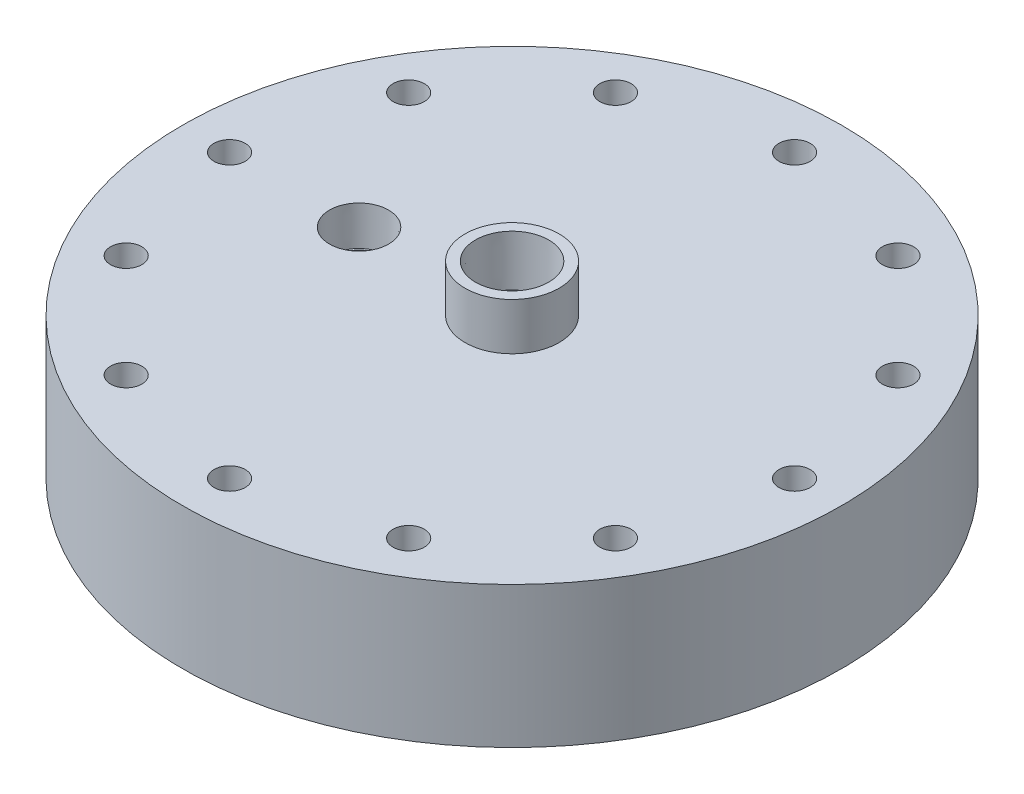
ISO-10303-21;
HEADER;
FILE_DESCRIPTION(('STEP AP214'),'2;1');
FILE_NAME('part.step','',(''),(''),'','','');
FILE_SCHEMA(('AUTOMOTIVE_DESIGN { 1 0 10303 214 1 1 1 1 }'));
ENDSEC;
DATA;
#1=APPLICATION_CONTEXT('core data for automotive mechanical design processes');
#2=APPLICATION_PROTOCOL_DEFINITION('international standard','automotive_design',2000,#1);
#3=PRODUCT_CONTEXT('',#1,'mechanical');
#4=PRODUCT('Part','Part','',(#3));
#5=PRODUCT_RELATED_PRODUCT_CATEGORY('part','',(#4));
#6=PRODUCT_DEFINITION_FORMATION('','',#4);
#7=PRODUCT_DEFINITION_CONTEXT('part definition',#1,'design');
#8=PRODUCT_DEFINITION('design','',#6,#7);
#9=PRODUCT_DEFINITION_SHAPE('','',#8);
#10=(LENGTH_UNIT() NAMED_UNIT(*) SI_UNIT(.MILLI.,.METRE.));
#11=(NAMED_UNIT(*) PLANE_ANGLE_UNIT() SI_UNIT($,.RADIAN.));
#12=(NAMED_UNIT(*) SI_UNIT($,.STERADIAN.) SOLID_ANGLE_UNIT());
#13=UNCERTAINTY_MEASURE_WITH_UNIT(LENGTH_MEASURE(1.E-05),#10,'distance_accuracy_value','');
#14=(GEOMETRIC_REPRESENTATION_CONTEXT(3) GLOBAL_UNCERTAINTY_ASSIGNED_CONTEXT((#13)) GLOBAL_UNIT_ASSIGNED_CONTEXT((#10,
#11,#12)) REPRESENTATION_CONTEXT('',''));
#15=CARTESIAN_POINT('',(0.,0.,0.));
#16=DIRECTION('',(0.,0.,1.));
#17=DIRECTION('',(1.,0.,0.));
#18=AXIS2_PLACEMENT_3D('',#15,#16,#17);
#19=CARTESIAN_POINT('',(-31.75,12.7,0.));
#20=DIRECTION('',(0.,1.,0.));
#21=DIRECTION('',(0.,0.,1.));
#22=AXIS2_PLACEMENT_3D('',#19,#20,#21);
#23=PLANE('',#22);
#24=CARTESIAN_POINT('',(0.,12.7,0.));
#25=DIRECTION('',(0.,-1.,0.));
#26=DIRECTION('',(0.,0.,-1.));
#27=AXIS2_PLACEMENT_3D('',#24,#25,#26);
#28=CIRCLE('',#27,31.75);
#29=CARTESIAN_POINT('',(0.,12.7,-31.75));
#30=VERTEX_POINT('',#29);
#31=EDGE_CURVE('E73',#30,#30,#28,.T.);
#32=ORIENTED_EDGE('',*,*,#31,.F.);
#33=EDGE_LOOP('',(#32));
#34=FACE_BOUND('',#33,.T.);
#35=CARTESIAN_POINT('',(0.,12.7,0.));
#36=DIRECTION('',(0.,-1.,0.));
#37=DIRECTION('',(0.,0.,-1.));
#38=AXIS2_PLACEMENT_3D('',#35,#36,#37);
#39=CIRCLE('',#38,50.8);
#40=CARTESIAN_POINT('',(0.,12.7,-50.8));
#41=VERTEX_POINT('',#40);
#42=EDGE_CURVE('E77',#41,#41,#39,.T.);
#43=ORIENTED_EDGE('',*,*,#42,.T.);
#44=EDGE_LOOP('',(#43));
#45=FACE_BOUND('',#44,.T.);
#46=CARTESIAN_POINT('',(-41.275,12.7,0.));
#47=DIRECTION('',(0.,1.,0.));
#48=DIRECTION('',(0.,0.,1.));
#49=AXIS2_PLACEMENT_3D('',#46,#47,#48);
#50=CIRCLE('',#49,7.1374);
#51=CARTESIAN_POINT('',(-41.275,12.7,7.1374));
#52=VERTEX_POINT('',#51);
#53=EDGE_CURVE('E117',#52,#52,#50,.F.);
#54=ORIENTED_EDGE('',*,*,#53,.F.);
#55=EDGE_LOOP('',(#54));
#56=FACE_BOUND('',#55,.T.);
#57=ADVANCED_FACE('F41',(#34,#45,#56),#23,.F.);
#58=CARTESIAN_POINT('',(0.,0.,0.));
#59=DIRECTION('',(0.,-1.,0.));
#60=DIRECTION('',(0.,0.,-1.));
#61=AXIS2_PLACEMENT_3D('',#58,#59,#60);
#62=CYLINDRICAL_SURFACE('',#61,88.9);
#63=CARTESIAN_POINT('',(0.,0.,0.));
#64=DIRECTION('',(0.,-1.,0.));
#65=DIRECTION('',(0.,0.,-1.));
#66=AXIS2_PLACEMENT_3D('',#63,#64,#65);
#67=CIRCLE('',#66,88.9);
#68=CARTESIAN_POINT('',(0.,0.,-88.9));
#69=VERTEX_POINT('',#68);
#70=EDGE_CURVE('E101',#69,#69,#67,.T.);
#71=ORIENTED_EDGE('',*,*,#70,.F.);
#72=EDGE_LOOP('',(#71));
#73=FACE_BOUND('',#72,.T.);
#74=CARTESIAN_POINT('',(0.,38.1,0.));
#75=DIRECTION('',(0.,-1.,0.));
#76=DIRECTION('',(0.,0.,-1.));
#77=AXIS2_PLACEMENT_3D('',#74,#75,#76);
#78=CIRCLE('',#77,88.9);
#79=CARTESIAN_POINT('',(0.,38.1,-88.9));
#80=VERTEX_POINT('',#79);
#81=EDGE_CURVE('E10',#80,#80,#78,.T.);
#82=ORIENTED_EDGE('',*,*,#81,.T.);
#83=EDGE_LOOP('',(#82));
#84=FACE_BOUND('',#83,.T.);
#85=ADVANCED_FACE('F43',(#73,#84),#62,.T.);
#86=CARTESIAN_POINT('',(-88.9,38.1,0.));
#87=DIRECTION('',(0.,-1.,0.));
#88=DIRECTION('',(0.,0.,-1.));
#89=AXIS2_PLACEMENT_3D('',#86,#87,#88);
#90=PLANE('',#89);
#91=CARTESIAN_POINT('',(-38.0999999999999,38.1,65.9911357683743));
#92=DIRECTION('',(0.,1.,0.));
#93=DIRECTION('',(0.86602540378444,0.,0.499999999999998));
#94=AXIS2_PLACEMENT_3D('',#91,#92,#93);
#95=CIRCLE('',#94,4.21639999999999);
#96=CARTESIAN_POINT('',(-34.4484904874831,38.1,68.0993357683743));
#97=VERTEX_POINT('',#96);
#98=EDGE_CURVE('E149',#97,#97,#95,.T.);
#99=ORIENTED_EDGE('',*,*,#98,.F.);
#100=EDGE_LOOP('',(#99));
#101=FACE_BOUND('',#100,.T.);
#102=CARTESIAN_POINT('',(2.66050878019847E-13,38.1,76.2));
#103=DIRECTION('',(0.,1.,0.));
#104=DIRECTION('',(1.,0.,0.));
#105=AXIS2_PLACEMENT_3D('',#102,#103,#104);
#106=CIRCLE('',#105,4.21639999999999);
#107=CARTESIAN_POINT('',(4.21640000000026,38.1,76.2));
#108=VERTEX_POINT('',#107);
#109=EDGE_CURVE('E200',#108,#108,#106,.T.);
#110=ORIENTED_EDGE('',*,*,#109,.F.);
#111=EDGE_LOOP('',(#110));
#112=FACE_BOUND('',#111,.T.);
#113=CARTESIAN_POINT('',(38.1000000000003,38.1,65.9911357683741));
#114=DIRECTION('',(0.,1.,0.));
#115=DIRECTION('',(0.866025403784436,0.,-0.500000000000004));
#116=AXIS2_PLACEMENT_3D('',#113,#114,#115);
#117=CIRCLE('',#116,4.21639999999999);
#118=CARTESIAN_POINT('',(41.751509512517,38.1,63.882935768374));
#119=VERTEX_POINT('',#118);
#120=EDGE_CURVE('E192',#119,#119,#117,.T.);
#121=ORIENTED_EDGE('',*,*,#120,.F.);
#122=EDGE_LOOP('',(#121));
#123=FACE_BOUND('',#122,.T.);
#124=CARTESIAN_POINT('',(65.9911357683744,38.1,38.0999999999996));
#125=DIRECTION('',(0.,1.,0.));
#126=DIRECTION('',(0.499999999999995,0.,-0.866025403784442));
#127=AXIS2_PLACEMENT_3D('',#124,#125,#126);
#128=CIRCLE('',#127,4.21639999999999);
#129=CARTESIAN_POINT('',(68.0993357683744,38.1,34.4484904874829));
#130=VERTEX_POINT('',#129);
#131=EDGE_CURVE('E184',#130,#130,#128,.T.);
#132=ORIENTED_EDGE('',*,*,#131,.F.);
#133=EDGE_LOOP('',(#132));
#134=FACE_BOUND('',#133,.T.);
#135=CARTESIAN_POINT('',(76.2,38.1,0.));
#136=DIRECTION('',(0.,1.,0.));
#137=DIRECTION('',(0.,0.,-1.));
#138=AXIS2_PLACEMENT_3D('',#135,#136,#137);
#139=CIRCLE('',#138,4.21639999999999);
#140=CARTESIAN_POINT('',(76.2,38.1,-4.21639999999999));
#141=VERTEX_POINT('',#140);
#142=EDGE_CURVE('E176',#141,#141,#139,.T.);
#143=ORIENTED_EDGE('',*,*,#142,.F.);
#144=EDGE_LOOP('',(#143));
#145=FACE_BOUND('',#144,.T.);
#146=CARTESIAN_POINT('',(65.9911357683739,38.1,-38.1000000000005));
#147=DIRECTION('',(0.,1.,0.));
#148=DIRECTION('',(-0.500000000000007,0.,-0.866025403784435));
#149=AXIS2_PLACEMENT_3D('',#146,#147,#148);
#150=CIRCLE('',#149,4.21639999999999);
#151=CARTESIAN_POINT('',(63.8829357683739,38.1,-41.7515095125172));
#152=VERTEX_POINT('',#151);
#153=EDGE_CURVE('E168',#152,#152,#150,.T.);
#154=ORIENTED_EDGE('',*,*,#153,.F.);
#155=EDGE_LOOP('',(#154));
#156=FACE_BOUND('',#155,.T.);
#157=CARTESIAN_POINT('',(38.0999999999994,38.1,-65.9911357683746));
#158=DIRECTION('',(0.,1.,0.));
#159=DIRECTION('',(-0.866025403784443,0.,-0.499999999999992));
#160=AXIS2_PLACEMENT_3D('',#157,#158,#159);
#161=CIRCLE('',#160,4.21639999999999);
#162=CARTESIAN_POINT('',(34.4484904874827,38.1,-68.0993357683745));
#163=VERTEX_POINT('',#162);
#164=EDGE_CURVE('E160',#163,#163,#161,.T.);
#165=ORIENTED_EDGE('',*,*,#164,.F.);
#166=EDGE_LOOP('',(#165));
#167=FACE_BOUND('',#166,.T.);
#168=CARTESIAN_POINT('',(-7.9815263405954E-13,38.1,-76.2));
#169=DIRECTION('',(0.,1.,0.));
#170=DIRECTION('',(-1.,0.,0.));
#171=AXIS2_PLACEMENT_3D('',#168,#169,#170);
#172=CIRCLE('',#171,4.21639999999999);
#173=CARTESIAN_POINT('',(-4.21640000000079,38.1,-76.2));
#174=VERTEX_POINT('',#173);
#175=EDGE_CURVE('E150',#174,#174,#172,.T.);
#176=ORIENTED_EDGE('',*,*,#175,.F.);
#177=EDGE_LOOP('',(#176));
#178=FACE_BOUND('',#177,.T.);
#179=CARTESIAN_POINT('',(-38.1000000000008,38.1,-65.9911357683738));
#180=DIRECTION('',(0.,1.,0.));
#181=DIRECTION('',(-0.866025403784433,0.,0.50000000000001));
#182=AXIS2_PLACEMENT_3D('',#179,#180,#181);
#183=CIRCLE('',#182,4.21639999999999);
#184=CARTESIAN_POINT('',(-41.7515095125175,38.1,-63.8829357683737));
#185=VERTEX_POINT('',#184);
#186=EDGE_CURVE('E159',#185,#185,#183,.T.);
#187=ORIENTED_EDGE('',*,*,#186,.F.);
#188=EDGE_LOOP('',(#187));
#189=FACE_BOUND('',#188,.T.);
#190=CARTESIAN_POINT('',(-65.9911357683747,38.1,-38.0999999999992));
#191=DIRECTION('',(0.,1.,0.));
#192=DIRECTION('',(-0.499999999999989,0.,0.866025403784445));
#193=AXIS2_PLACEMENT_3D('',#190,#191,#192);
#194=CIRCLE('',#193,4.21639999999999);
#195=CARTESIAN_POINT('',(-68.0993357683747,38.1,-34.4484904874824));
#196=VERTEX_POINT('',#195);
#197=EDGE_CURVE('E214',#196,#196,#194,.T.);
#198=ORIENTED_EDGE('',*,*,#197,.F.);
#199=EDGE_LOOP('',(#198));
#200=FACE_BOUND('',#199,.T.);
#201=CARTESIAN_POINT('',(-65.9911357683742,38.1,38.1000000000001));
#202=DIRECTION('',(0.,1.,0.));
#203=DIRECTION('',(0.500000000000001,0.,0.866025403784438));
#204=AXIS2_PLACEMENT_3D('',#201,#202,#203);
#205=CIRCLE('',#204,4.21639999999999);
#206=CARTESIAN_POINT('',(-63.8829357683742,38.1,41.7515095125168));
#207=VERTEX_POINT('',#206);
#208=EDGE_CURVE('E141',#207,#207,#205,.T.);
#209=ORIENTED_EDGE('',*,*,#208,.F.);
#210=EDGE_LOOP('',(#209));
#211=FACE_BOUND('',#210,.T.);
#212=CARTESIAN_POINT('',(-76.2,38.1,0.));
#213=DIRECTION('',(0.,1.,0.));
#214=DIRECTION('',(0.,0.,1.));
#215=AXIS2_PLACEMENT_3D('',#212,#213,#214);
#216=CIRCLE('',#215,4.21639999999999);
#217=CARTESIAN_POINT('',(-76.2,38.1,4.21639999999999));
#218=VERTEX_POINT('',#217);
#219=EDGE_CURVE('E137',#218,#218,#216,.T.);
#220=ORIENTED_EDGE('',*,*,#219,.F.);
#221=EDGE_LOOP('',(#220));
#222=FACE_BOUND('',#221,.T.);
#223=CARTESIAN_POINT('',(-41.275,38.1,0.));
#224=DIRECTION('',(0.,1.,0.));
#225=DIRECTION('',(0.,0.,1.));
#226=AXIS2_PLACEMENT_3D('',#223,#224,#225);
#227=CIRCLE('',#226,7.9655416);
#228=CARTESIAN_POINT('',(-41.275,38.1,7.9655416));
#229=VERTEX_POINT('',#228);
#230=EDGE_CURVE('E126',#229,#229,#227,.T.);
#231=ORIENTED_EDGE('',*,*,#230,.F.);
#232=EDGE_LOOP('',(#231));
#233=FACE_BOUND('',#232,.T.);
#234=ORIENTED_EDGE('',*,*,#81,.F.);
#235=EDGE_LOOP('',(#234));
#236=FACE_BOUND('',#235,.T.);
#237=CARTESIAN_POINT('',(0.,38.1,0.));
#238=DIRECTION('',(0.,-1.,0.));
#239=DIRECTION('',(0.,0.,-1.));
#240=AXIS2_PLACEMENT_3D('',#237,#238,#239);
#241=CIRCLE('',#240,12.7);
#242=CARTESIAN_POINT('',(0.,38.1,-12.7));
#243=VERTEX_POINT('',#242);
#244=EDGE_CURVE('E50',#243,#243,#241,.T.);
#245=ORIENTED_EDGE('',*,*,#244,.T.);
#246=EDGE_LOOP('',(#245));
#247=FACE_BOUND('',#246,.T.);
#248=ADVANCED_FACE('F241',(#101,#112,#123,#134,#145,#156,#167,#178,#189,#200,#211,#222,#233,
#236,#247),#90,.F.);
#249=CARTESIAN_POINT('',(0.,0.,0.));
#250=DIRECTION('',(0.,-1.,0.));
#251=DIRECTION('',(0.,0.,-1.));
#252=AXIS2_PLACEMENT_3D('',#249,#250,#251);
#253=CYLINDRICAL_SURFACE('',#252,12.7);
#254=ORIENTED_EDGE('',*,*,#244,.F.);
#255=EDGE_LOOP('',(#254));
#256=FACE_BOUND('',#255,.T.);
#257=CARTESIAN_POINT('',(0.,50.8,0.));
#258=DIRECTION('',(0.,-1.,0.));
#259=DIRECTION('',(0.,0.,-1.));
#260=AXIS2_PLACEMENT_3D('',#257,#258,#259);
#261=CIRCLE('',#260,12.7);
#262=CARTESIAN_POINT('',(0.,50.8,-12.7));
#263=VERTEX_POINT('',#262);
#264=EDGE_CURVE('E55',#263,#263,#261,.T.);
#265=ORIENTED_EDGE('',*,*,#264,.T.);
#266=EDGE_LOOP('',(#265));
#267=FACE_BOUND('',#266,.T.);
#268=ADVANCED_FACE('F244',(#256,#267),#253,.T.);
#269=CARTESIAN_POINT('',(-12.7,50.8,0.));
#270=DIRECTION('',(0.,-1.,0.));
#271=DIRECTION('',(0.,0.,-1.));
#272=AXIS2_PLACEMENT_3D('',#269,#270,#271);
#273=PLANE('',#272);
#274=CARTESIAN_POINT('',(0.,50.8,0.));
#275=DIRECTION('',(0.,1.,0.));
#276=DIRECTION('',(0.,0.,1.));
#277=AXIS2_PLACEMENT_3D('',#274,#275,#276);
#278=CIRCLE('',#277,9.8827971);
#279=CARTESIAN_POINT('',(0.,50.8,9.8827971));
#280=VERTEX_POINT('',#279);
#281=EDGE_CURVE('E113',#280,#280,#278,.T.);
#282=ORIENTED_EDGE('',*,*,#281,.F.);
#283=EDGE_LOOP('',(#282));
#284=FACE_BOUND('',#283,.T.);
#285=ORIENTED_EDGE('',*,*,#264,.F.);
#286=EDGE_LOOP('',(#285));
#287=FACE_BOUND('',#286,.T.);
#288=ADVANCED_FACE('F259',(#284,#287),#273,.F.);
#289=CARTESIAN_POINT('',(-25.4,31.75,0.));
#290=DIRECTION('',(0.,1.,0.));
#291=DIRECTION('',(0.,0.,1.));
#292=AXIS2_PLACEMENT_3D('',#289,#290,#291);
#293=PLANE('',#292);
#294=CARTESIAN_POINT('',(0.,31.75,0.));
#295=DIRECTION('',(0.,1.,0.));
#296=DIRECTION('',(0.,0.,1.));
#297=AXIS2_PLACEMENT_3D('',#294,#295,#296);
#298=CIRCLE('',#297,8.9281);
#299=CARTESIAN_POINT('',(0.,31.75,8.9281));
#300=VERTEX_POINT('',#299);
#301=EDGE_CURVE('E45',#300,#300,#298,.T.);
#302=ORIENTED_EDGE('',*,*,#301,.T.);
#303=EDGE_LOOP('',(#302));
#304=FACE_BOUND('',#303,.T.);
#305=CARTESIAN_POINT('',(0.,31.75,0.));
#306=DIRECTION('',(0.,-1.,0.));
#307=DIRECTION('',(0.,0.,-1.));
#308=AXIS2_PLACEMENT_3D('',#305,#306,#307);
#309=CIRCLE('',#308,25.4);
#310=CARTESIAN_POINT('',(0.,31.75,-25.4));
#311=VERTEX_POINT('',#310);
#312=EDGE_CURVE('E61',#311,#311,#309,.T.);
#313=ORIENTED_EDGE('',*,*,#312,.T.);
#314=EDGE_LOOP('',(#313));
#315=FACE_BOUND('',#314,.T.);
#316=ADVANCED_FACE('F264',(#304,#315),#293,.F.);
#317=CARTESIAN_POINT('',(0.,0.,0.));
#318=DIRECTION('',(0.,-1.,0.));
#319=DIRECTION('',(0.,0.,-1.));
#320=AXIS2_PLACEMENT_3D('',#317,#318,#319);
#321=CYLINDRICAL_SURFACE('',#320,25.4);
#322=ORIENTED_EDGE('',*,*,#312,.F.);
#323=EDGE_LOOP('',(#322));
#324=FACE_BOUND('',#323,.T.);
#325=CARTESIAN_POINT('',(0.,19.05,0.));
#326=DIRECTION('',(0.,-1.,0.));
#327=DIRECTION('',(0.,0.,-1.));
#328=AXIS2_PLACEMENT_3D('',#325,#326,#327);
#329=CIRCLE('',#328,25.4);
#330=CARTESIAN_POINT('',(0.,19.05,-25.4));
#331=VERTEX_POINT('',#330);
#332=EDGE_CURVE('E65',#331,#331,#329,.T.);
#333=ORIENTED_EDGE('',*,*,#332,.T.);
#334=EDGE_LOOP('',(#333));
#335=FACE_BOUND('',#334,.T.);
#336=ADVANCED_FACE('F270',(#324,#335),#321,.F.);
#337=CARTESIAN_POINT('',(-25.4,19.05,0.));
#338=DIRECTION('',(0.,1.,0.));
#339=DIRECTION('',(0.,0.,1.));
#340=AXIS2_PLACEMENT_3D('',#337,#338,#339);
#341=PLANE('',#340);
#342=ORIENTED_EDGE('',*,*,#332,.F.);
#343=EDGE_LOOP('',(#342));
#344=FACE_BOUND('',#343,.T.);
#345=CARTESIAN_POINT('',(0.,19.05,0.));
#346=DIRECTION('',(0.,-1.,0.));
#347=DIRECTION('',(0.,0.,-1.));
#348=AXIS2_PLACEMENT_3D('',#345,#346,#347);
#349=CIRCLE('',#348,31.75);
#350=CARTESIAN_POINT('',(0.,19.05,-31.75));
#351=VERTEX_POINT('',#350);
#352=EDGE_CURVE('E69',#351,#351,#349,.T.);
#353=ORIENTED_EDGE('',*,*,#352,.T.);
#354=EDGE_LOOP('',(#353));
#355=FACE_BOUND('',#354,.T.);
#356=ADVANCED_FACE('F290',(#344,#355),#341,.F.);
#357=CARTESIAN_POINT('',(0.,0.,0.));
#358=DIRECTION('',(0.,-1.,0.));
#359=DIRECTION('',(0.,0.,-1.));
#360=AXIS2_PLACEMENT_3D('',#357,#358,#359);
#361=CYLINDRICAL_SURFACE('',#360,31.75);
#362=ORIENTED_EDGE('',*,*,#352,.F.);
#363=EDGE_LOOP('',(#362));
#364=FACE_BOUND('',#363,.T.);
#365=ORIENTED_EDGE('',*,*,#31,.T.);
#366=EDGE_LOOP('',(#365));
#367=FACE_BOUND('',#366,.T.);
#368=ADVANCED_FACE('F287',(#364,#367),#361,.F.);
#369=CARTESIAN_POINT('',(0.,0.,0.));
#370=DIRECTION('',(0.,-1.,0.));
#371=DIRECTION('',(0.,0.,-1.));
#372=AXIS2_PLACEMENT_3D('',#369,#370,#371);
#373=CYLINDRICAL_SURFACE('',#372,50.8);
#374=ORIENTED_EDGE('',*,*,#42,.F.);
#375=EDGE_LOOP('',(#374));
#376=FACE_BOUND('',#375,.T.);
#377=CARTESIAN_POINT('',(0.,0.,0.));
#378=DIRECTION('',(0.,-1.,0.));
#379=DIRECTION('',(0.,0.,-1.));
#380=AXIS2_PLACEMENT_3D('',#377,#378,#379);
#381=CIRCLE('',#380,50.8);
#382=CARTESIAN_POINT('',(0.,0.,-50.8));
#383=VERTEX_POINT('',#382);
#384=EDGE_CURVE('E81',#383,#383,#381,.T.);
#385=ORIENTED_EDGE('',*,*,#384,.T.);
#386=EDGE_LOOP('',(#385));
#387=FACE_BOUND('',#386,.T.);
#388=ADVANCED_FACE('F285',(#376,#387),#373,.F.);
#389=CARTESIAN_POINT('',(-50.8,0.,0.));
#390=DIRECTION('',(0.,1.,0.));
#391=DIRECTION('',(0.,0.,1.));
#392=AXIS2_PLACEMENT_3D('',#389,#390,#391);
#393=PLANE('',#392);
#394=ORIENTED_EDGE('',*,*,#384,.F.);
#395=EDGE_LOOP('',(#394));
#396=FACE_BOUND('',#395,.T.);
#397=CARTESIAN_POINT('',(0.,0.,0.));
#398=DIRECTION('',(0.,-1.,0.));
#399=DIRECTION('',(0.,0.,-1.));
#400=AXIS2_PLACEMENT_3D('',#397,#398,#399);
#401=CIRCLE('',#400,52.3875);
#402=CARTESIAN_POINT('',(0.,0.,-52.3875));
#403=VERTEX_POINT('',#402);
#404=EDGE_CURVE('E85',#403,#403,#401,.T.);
#405=ORIENTED_EDGE('',*,*,#404,.T.);
#406=EDGE_LOOP('',(#405));
#407=FACE_BOUND('',#406,.T.);
#408=ADVANCED_FACE('F323',(#396,#407),#393,.F.);
#409=CARTESIAN_POINT('',(0.,0.,0.));
#410=DIRECTION('',(0.,-1.,0.));
#411=DIRECTION('',(0.,0.,-1.));
#412=AXIS2_PLACEMENT_3D('',#409,#410,#411);
#413=CYLINDRICAL_SURFACE('',#412,52.3875);
#414=ORIENTED_EDGE('',*,*,#404,.F.);
#415=EDGE_LOOP('',(#414));
#416=FACE_BOUND('',#415,.T.);
#417=CARTESIAN_POINT('',(0.,2.54,0.));
#418=DIRECTION('',(0.,-1.,0.));
#419=DIRECTION('',(0.,0.,-1.));
#420=AXIS2_PLACEMENT_3D('',#417,#418,#419);
#421=CIRCLE('',#420,52.3875);
#422=CARTESIAN_POINT('',(0.,2.54,-52.3875));
#423=VERTEX_POINT('',#422);
#424=EDGE_CURVE('E89',#423,#423,#421,.T.);
#425=ORIENTED_EDGE('',*,*,#424,.T.);
#426=EDGE_LOOP('',(#425));
#427=FACE_BOUND('',#426,.T.);
#428=ADVANCED_FACE('F330',(#416,#427),#413,.T.);
#429=CARTESIAN_POINT('',(-52.3875,2.54,0.));
#430=DIRECTION('',(0.,1.,0.));
#431=DIRECTION('',(0.,0.,1.));
#432=AXIS2_PLACEMENT_3D('',#429,#430,#431);
#433=PLANE('',#432);
#434=ORIENTED_EDGE('',*,*,#424,.F.);
#435=EDGE_LOOP('',(#434));
#436=FACE_BOUND('',#435,.T.);
#437=CARTESIAN_POINT('',(0.,2.54,0.));
#438=DIRECTION('',(0.,-1.,0.));
#439=DIRECTION('',(0.,0.,-1.));
#440=AXIS2_PLACEMENT_3D('',#437,#438,#439);
#441=CIRCLE('',#440,55.9435);
#442=CARTESIAN_POINT('',(0.,2.54,-55.9435));
#443=VERTEX_POINT('',#442);
#444=EDGE_CURVE('E93',#443,#443,#441,.T.);
#445=ORIENTED_EDGE('',*,*,#444,.T.);
#446=EDGE_LOOP('',(#445));
#447=FACE_BOUND('',#446,.T.);
#448=ADVANCED_FACE('F337',(#436,#447),#433,.F.);
#449=CARTESIAN_POINT('',(0.,0.,0.));
#450=DIRECTION('',(0.,-1.,0.));
#451=DIRECTION('',(0.,0.,-1.));
#452=AXIS2_PLACEMENT_3D('',#449,#450,#451);
#453=CYLINDRICAL_SURFACE('',#452,55.9435);
#454=ORIENTED_EDGE('',*,*,#444,.F.);
#455=EDGE_LOOP('',(#454));
#456=FACE_BOUND('',#455,.T.);
#457=CARTESIAN_POINT('',(0.,0.,0.));
#458=DIRECTION('',(0.,-1.,0.));
#459=DIRECTION('',(0.,0.,-1.));
#460=AXIS2_PLACEMENT_3D('',#457,#458,#459);
#461=CIRCLE('',#460,55.9435);
#462=CARTESIAN_POINT('',(0.,0.,-55.9435));
#463=VERTEX_POINT('',#462);
#464=EDGE_CURVE('E97',#463,#463,#461,.T.);
#465=ORIENTED_EDGE('',*,*,#464,.T.);
#466=EDGE_LOOP('',(#465));
#467=FACE_BOUND('',#466,.T.);
#468=ADVANCED_FACE('F345',(#456,#467),#453,.F.);
#469=CARTESIAN_POINT('',(-55.9435,0.,0.));
#470=DIRECTION('',(0.,1.,0.));
#471=DIRECTION('',(0.,0.,1.));
#472=AXIS2_PLACEMENT_3D('',#469,#470,#471);
#473=PLANE('',#472);
#474=CARTESIAN_POINT('',(-38.0999999999999,0.,65.9911357683743));
#475=DIRECTION('',(0.,1.,0.));
#476=DIRECTION('',(0.86602540378444,0.,0.499999999999998));
#477=AXIS2_PLACEMENT_3D('',#474,#475,#476);
#478=CIRCLE('',#477,4.21639999999999);
#479=CARTESIAN_POINT('',(-34.4484904874831,0.,68.0993357683743));
#480=VERTEX_POINT('',#479);
#481=EDGE_CURVE('E204',#480,#480,#478,.T.);
#482=ORIENTED_EDGE('',*,*,#481,.T.);
#483=EDGE_LOOP('',(#482));
#484=FACE_BOUND('',#483,.T.);
#485=CARTESIAN_POINT('',(2.66050878019847E-13,0.,76.2));
#486=DIRECTION('',(0.,1.,0.));
#487=DIRECTION('',(1.,0.,0.));
#488=AXIS2_PLACEMENT_3D('',#485,#486,#487);
#489=CIRCLE('',#488,4.21639999999999);
#490=CARTESIAN_POINT('',(4.21640000000026,0.,76.2));
#491=VERTEX_POINT('',#490);
#492=EDGE_CURVE('E196',#491,#491,#489,.T.);
#493=ORIENTED_EDGE('',*,*,#492,.T.);
#494=EDGE_LOOP('',(#493));
#495=FACE_BOUND('',#494,.T.);
#496=CARTESIAN_POINT('',(38.1000000000003,0.,65.9911357683741));
#497=DIRECTION('',(0.,1.,0.));
#498=DIRECTION('',(0.866025403784436,0.,-0.500000000000004));
#499=AXIS2_PLACEMENT_3D('',#496,#497,#498);
#500=CIRCLE('',#499,4.21639999999999);
#501=CARTESIAN_POINT('',(41.751509512517,0.,63.882935768374));
#502=VERTEX_POINT('',#501);
#503=EDGE_CURVE('E188',#502,#502,#500,.T.);
#504=ORIENTED_EDGE('',*,*,#503,.T.);
#505=EDGE_LOOP('',(#504));
#506=FACE_BOUND('',#505,.T.);
#507=CARTESIAN_POINT('',(65.9911357683744,0.,38.0999999999996));
#508=DIRECTION('',(0.,1.,0.));
#509=DIRECTION('',(0.499999999999995,0.,-0.866025403784442));
#510=AXIS2_PLACEMENT_3D('',#507,#508,#509);
#511=CIRCLE('',#510,4.21639999999999);
#512=CARTESIAN_POINT('',(68.0993357683744,0.,34.4484904874829));
#513=VERTEX_POINT('',#512);
#514=EDGE_CURVE('E180',#513,#513,#511,.T.);
#515=ORIENTED_EDGE('',*,*,#514,.T.);
#516=EDGE_LOOP('',(#515));
#517=FACE_BOUND('',#516,.T.);
#518=CARTESIAN_POINT('',(76.2,0.,0.));
#519=DIRECTION('',(0.,1.,0.));
#520=DIRECTION('',(0.,0.,-1.));
#521=AXIS2_PLACEMENT_3D('',#518,#519,#520);
#522=CIRCLE('',#521,4.21639999999999);
#523=CARTESIAN_POINT('',(76.2,0.,-4.21639999999999));
#524=VERTEX_POINT('',#523);
#525=EDGE_CURVE('E172',#524,#524,#522,.T.);
#526=ORIENTED_EDGE('',*,*,#525,.T.);
#527=EDGE_LOOP('',(#526));
#528=FACE_BOUND('',#527,.T.);
#529=CARTESIAN_POINT('',(65.9911357683739,0.,-38.1000000000005));
#530=DIRECTION('',(0.,1.,0.));
#531=DIRECTION('',(-0.500000000000007,0.,-0.866025403784435));
#532=AXIS2_PLACEMENT_3D('',#529,#530,#531);
#533=CIRCLE('',#532,4.21639999999999);
#534=CARTESIAN_POINT('',(63.8829357683739,0.,-41.7515095125172));
#535=VERTEX_POINT('',#534);
#536=EDGE_CURVE('E164',#535,#535,#533,.T.);
#537=ORIENTED_EDGE('',*,*,#536,.T.);
#538=EDGE_LOOP('',(#537));
#539=FACE_BOUND('',#538,.T.);
#540=CARTESIAN_POINT('',(38.0999999999994,0.,-65.9911357683746));
#541=DIRECTION('',(0.,1.,0.));
#542=DIRECTION('',(-0.866025403784443,0.,-0.499999999999992));
#543=AXIS2_PLACEMENT_3D('',#540,#541,#542);
#544=CIRCLE('',#543,4.21639999999999);
#545=CARTESIAN_POINT('',(34.4484904874827,0.,-68.0993357683745));
#546=VERTEX_POINT('',#545);
#547=EDGE_CURVE('E154',#546,#546,#544,.T.);
#548=ORIENTED_EDGE('',*,*,#547,.T.);
#549=EDGE_LOOP('',(#548));
#550=FACE_BOUND('',#549,.T.);
#551=CARTESIAN_POINT('',(-7.9815263405954E-13,0.,-76.2));
#552=DIRECTION('',(0.,1.,0.));
#553=DIRECTION('',(-1.,0.,0.));
#554=AXIS2_PLACEMENT_3D('',#551,#552,#553);
#555=CIRCLE('',#554,4.21639999999999);
#556=CARTESIAN_POINT('',(-4.21640000000079,0.,-76.2));
#557=VERTEX_POINT('',#556);
#558=EDGE_CURVE('E155',#557,#557,#555,.T.);
#559=ORIENTED_EDGE('',*,*,#558,.T.);
#560=EDGE_LOOP('',(#559));
#561=FACE_BOUND('',#560,.T.);
#562=CARTESIAN_POINT('',(-38.1000000000008,0.,-65.9911357683738));
#563=DIRECTION('',(0.,1.,0.));
#564=DIRECTION('',(-0.866025403784433,0.,0.50000000000001));
#565=AXIS2_PLACEMENT_3D('',#562,#563,#564);
#566=CIRCLE('',#565,4.21639999999999);
#567=CARTESIAN_POINT('',(-41.7515095125175,0.,-63.8829357683737));
#568=VERTEX_POINT('',#567);
#569=EDGE_CURVE('E218',#568,#568,#566,.T.);
#570=ORIENTED_EDGE('',*,*,#569,.T.);
#571=EDGE_LOOP('',(#570));
#572=FACE_BOUND('',#571,.T.);
#573=CARTESIAN_POINT('',(-65.9911357683747,0.,-38.0999999999992));
#574=DIRECTION('',(0.,1.,0.));
#575=DIRECTION('',(-0.499999999999989,0.,0.866025403784445));
#576=AXIS2_PLACEMENT_3D('',#573,#574,#575);
#577=CIRCLE('',#576,4.21639999999999);
#578=CARTESIAN_POINT('',(-68.0993357683747,0.,-34.4484904874824));
#579=VERTEX_POINT('',#578);
#580=EDGE_CURVE('E219',#579,#579,#577,.T.);
#581=ORIENTED_EDGE('',*,*,#580,.T.);
#582=EDGE_LOOP('',(#581));
#583=FACE_BOUND('',#582,.T.);
#584=CARTESIAN_POINT('',(-65.9911357683742,0.,38.1000000000001));
#585=DIRECTION('',(0.,1.,0.));
#586=DIRECTION('',(0.500000000000001,0.,0.866025403784438));
#587=AXIS2_PLACEMENT_3D('',#584,#585,#586);
#588=CIRCLE('',#587,4.21639999999999);
#589=CARTESIAN_POINT('',(-63.8829357683742,0.,41.7515095125168));
#590=VERTEX_POINT('',#589);
#591=EDGE_CURVE('E145',#590,#590,#588,.T.);
#592=ORIENTED_EDGE('',*,*,#591,.T.);
#593=EDGE_LOOP('',(#592));
#594=FACE_BOUND('',#593,.T.);
#595=CARTESIAN_POINT('',(-76.2,0.,0.));
#596=DIRECTION('',(0.,1.,0.));
#597=DIRECTION('',(0.,0.,1.));
#598=AXIS2_PLACEMENT_3D('',#595,#596,#597);
#599=CIRCLE('',#598,4.21639999999999);
#600=CARTESIAN_POINT('',(-76.2,0.,4.21639999999999));
#601=VERTEX_POINT('',#600);
#602=EDGE_CURVE('E130',#601,#601,#599,.T.);
#603=ORIENTED_EDGE('',*,*,#602,.T.);
#604=EDGE_LOOP('',(#603));
#605=FACE_BOUND('',#604,.T.);
#606=ORIENTED_EDGE('',*,*,#464,.F.);
#607=EDGE_LOOP('',(#606));
#608=FACE_BOUND('',#607,.T.);
#609=ORIENTED_EDGE('',*,*,#70,.T.);
#610=EDGE_LOOP('',(#609));
#611=FACE_BOUND('',#610,.T.);
#612=ADVANCED_FACE('F230',(#484,#495,#506,#517,#528,#539,#550,#561,#572,#583,#594,#605,#608,
#611),#473,.F.);
#613=CARTESIAN_POINT('',(0.,50.8,0.));
#614=DIRECTION('',(0.,1.,0.));
#615=DIRECTION('',(0.,0.,1.));
#616=AXIS2_PLACEMENT_3D('',#613,#614,#615);
#617=CYLINDRICAL_SURFACE('',#616,8.9281);
#618=CARTESIAN_POINT('',(0.,37.338,0.));
#619=DIRECTION('',(0.,1.,0.));
#620=DIRECTION('',(0.,0.,1.));
#621=AXIS2_PLACEMENT_3D('',#618,#619,#620);
#622=CIRCLE('',#621,8.9281);
#623=CARTESIAN_POINT('',(0.,37.338,8.9281));
#624=VERTEX_POINT('',#623);
#625=EDGE_CURVE('E105',#624,#624,#622,.T.);
#626=ORIENTED_EDGE('',*,*,#625,.T.);
#627=EDGE_LOOP('',(#626));
#628=FACE_BOUND('',#627,.T.);
#629=ORIENTED_EDGE('',*,*,#301,.F.);
#630=EDGE_LOOP('',(#629));
#631=FACE_BOUND('',#630,.T.);
#632=ADVANCED_FACE('F361',(#628,#631),#617,.F.);
#633=CARTESIAN_POINT('',(8.9281,37.338,0.));
#634=DIRECTION('',(0.,-1.,0.));
#635=DIRECTION('',(0.,0.,-1.));
#636=AXIS2_PLACEMENT_3D('',#633,#634,#635);
#637=PLANE('',#636);
#638=ORIENTED_EDGE('',*,*,#625,.F.);
#639=EDGE_LOOP('',(#638));
#640=FACE_BOUND('',#639,.T.);
#641=CARTESIAN_POINT('',(0.,37.338,0.));
#642=DIRECTION('',(0.,1.,0.));
#643=DIRECTION('',(0.,0.,1.));
#644=AXIS2_PLACEMENT_3D('',#641,#642,#643);
#645=CIRCLE('',#644,9.47972679208631);
#646=CARTESIAN_POINT('',(0.,37.338,9.47972679208631));
#647=VERTEX_POINT('',#646);
#648=EDGE_CURVE('E109',#647,#647,#645,.T.);
#649=ORIENTED_EDGE('',*,*,#648,.T.);
#650=EDGE_LOOP('',(#649));
#651=FACE_BOUND('',#650,.T.);
#652=ADVANCED_FACE('F371',(#640,#651),#637,.F.);
#653=CARTESIAN_POINT('',(0.,50.8,0.));
#654=DIRECTION('',(0.,1.,0.));
#655=DIRECTION('',(0.,0.,1.));
#656=AXIS2_PLACEMENT_3D('',#653,#654,#655);
#657=CONICAL_SURFACE('',#656,9.8827971,0.0299323966717031);
#658=ORIENTED_EDGE('',*,*,#648,.F.);
#659=EDGE_LOOP('',(#658));
#660=FACE_BOUND('',#659,.T.);
#661=ORIENTED_EDGE('',*,*,#281,.T.);
#662=EDGE_LOOP('',(#661));
#663=FACE_BOUND('',#662,.T.);
#664=ADVANCED_FACE('F379',(#660,#663),#657,.F.);
#665=CARTESIAN_POINT('',(-41.275,38.1,0.));
#666=DIRECTION('',(0.,1.,0.));
#667=DIRECTION('',(0.,0.,1.));
#668=AXIS2_PLACEMENT_3D('',#665,#666,#667);
#669=CYLINDRICAL_SURFACE('',#668,7.1374);
#670=ORIENTED_EDGE('',*,*,#53,.T.);
#671=EDGE_LOOP('',(#670));
#672=FACE_BOUND('',#671,.T.);
#673=CARTESIAN_POINT('',(-41.275,27.686,0.));
#674=DIRECTION('',(0.,1.,0.));
#675=DIRECTION('',(0.,0.,1.));
#676=AXIS2_PLACEMENT_3D('',#673,#674,#675);
#677=CIRCLE('',#676,7.1374);
#678=CARTESIAN_POINT('',(-41.275,27.686,7.1374));
#679=VERTEX_POINT('',#678);
#680=EDGE_CURVE('E118',#679,#679,#677,.T.);
#681=ORIENTED_EDGE('',*,*,#680,.T.);
#682=EDGE_LOOP('',(#681));
#683=FACE_BOUND('',#682,.T.);
#684=ADVANCED_FACE('F388',(#672,#683),#669,.F.);
#685=CARTESIAN_POINT('',(-34.1376,27.686,0.));
#686=DIRECTION('',(0.,-1.,0.));
#687=DIRECTION('',(0.,0.,-1.));
#688=AXIS2_PLACEMENT_3D('',#685,#686,#687);
#689=PLANE('',#688);
#690=ORIENTED_EDGE('',*,*,#680,.F.);
#691=EDGE_LOOP('',(#690));
#692=FACE_BOUND('',#691,.T.);
#693=CARTESIAN_POINT('',(-41.275,27.686,0.));
#694=DIRECTION('',(0.,1.,0.));
#695=DIRECTION('',(0.,0.,1.));
#696=AXIS2_PLACEMENT_3D('',#693,#694,#695);
#697=CIRCLE('',#696,7.65373249387809);
#698=CARTESIAN_POINT('',(-41.275,27.686,7.65373249387809));
#699=VERTEX_POINT('',#698);
#700=EDGE_CURVE('E122',#699,#699,#697,.T.);
#701=ORIENTED_EDGE('',*,*,#700,.T.);
#702=EDGE_LOOP('',(#701));
#703=FACE_BOUND('',#702,.T.);
#704=ADVANCED_FACE('F398',(#692,#703),#689,.F.);
#705=CARTESIAN_POINT('',(-41.275,38.1,0.));
#706=DIRECTION('',(0.,1.,0.));
#707=DIRECTION('',(0.,0.,1.));
#708=AXIS2_PLACEMENT_3D('',#705,#706,#707);
#709=CONICAL_SURFACE('',#708,7.9655416,0.0299323966717029);
#710=ORIENTED_EDGE('',*,*,#700,.F.);
#711=EDGE_LOOP('',(#710));
#712=FACE_BOUND('',#711,.T.);
#713=ORIENTED_EDGE('',*,*,#230,.T.);
#714=EDGE_LOOP('',(#713));
#715=FACE_BOUND('',#714,.T.);
#716=ADVANCED_FACE('F406',(#712,#715),#709,.F.);
#717=CARTESIAN_POINT('',(-76.2,38.1,0.));
#718=DIRECTION('',(0.,1.,0.));
#719=DIRECTION('',(0.,0.,1.));
#720=AXIS2_PLACEMENT_3D('',#717,#718,#719);
#721=CYLINDRICAL_SURFACE('',#720,4.21639999999999);
#722=ORIENTED_EDGE('',*,*,#602,.F.);
#723=EDGE_LOOP('',(#722));
#724=FACE_BOUND('',#723,.T.);
#725=ORIENTED_EDGE('',*,*,#219,.T.);
#726=EDGE_LOOP('',(#725));
#727=FACE_BOUND('',#726,.T.);
#728=ADVANCED_FACE('F415',(#724,#727),#721,.F.);
#729=CARTESIAN_POINT('',(-65.9911357683742,38.1,38.1000000000001));
#730=DIRECTION('',(0.,1.,0.));
#731=DIRECTION('',(0.500000000000001,0.,0.866025403784438));
#732=AXIS2_PLACEMENT_3D('',#729,#730,#731);
#733=CYLINDRICAL_SURFACE('',#732,4.21639999999999);
#734=ORIENTED_EDGE('',*,*,#591,.F.);
#735=EDGE_LOOP('',(#734));
#736=FACE_BOUND('',#735,.T.);
#737=ORIENTED_EDGE('',*,*,#208,.T.);
#738=EDGE_LOOP('',(#737));
#739=FACE_BOUND('',#738,.T.);
#740=ADVANCED_FACE('F423',(#736,#739),#733,.F.);
#741=CARTESIAN_POINT('',(-65.9911357683747,38.1,-38.0999999999992));
#742=DIRECTION('',(0.,1.,0.));
#743=DIRECTION('',(-0.499999999999989,0.,0.866025403784445));
#744=AXIS2_PLACEMENT_3D('',#741,#742,#743);
#745=CYLINDRICAL_SURFACE('',#744,4.21639999999999);
#746=ORIENTED_EDGE('',*,*,#580,.F.);
#747=EDGE_LOOP('',(#746));
#748=FACE_BOUND('',#747,.T.);
#749=ORIENTED_EDGE('',*,*,#197,.T.);
#750=EDGE_LOOP('',(#749));
#751=FACE_BOUND('',#750,.T.);
#752=ADVANCED_FACE('F237',(#748,#751),#745,.F.);
#753=CARTESIAN_POINT('',(-38.1000000000008,38.1,-65.9911357683738));
#754=DIRECTION('',(0.,1.,0.));
#755=DIRECTION('',(-0.866025403784433,0.,0.50000000000001));
#756=AXIS2_PLACEMENT_3D('',#753,#754,#755);
#757=CYLINDRICAL_SURFACE('',#756,4.21639999999999);
#758=ORIENTED_EDGE('',*,*,#569,.F.);
#759=EDGE_LOOP('',(#758));
#760=FACE_BOUND('',#759,.T.);
#761=ORIENTED_EDGE('',*,*,#186,.T.);
#762=EDGE_LOOP('',(#761));
#763=FACE_BOUND('',#762,.T.);
#764=ADVANCED_FACE('F233',(#760,#763),#757,.F.);
#765=CARTESIAN_POINT('',(-7.9815263405954E-13,38.1,-76.2));
#766=DIRECTION('',(0.,1.,0.));
#767=DIRECTION('',(-1.,0.,0.));
#768=AXIS2_PLACEMENT_3D('',#765,#766,#767);
#769=CYLINDRICAL_SURFACE('',#768,4.21639999999999);
#770=ORIENTED_EDGE('',*,*,#558,.F.);
#771=EDGE_LOOP('',(#770));
#772=FACE_BOUND('',#771,.T.);
#773=ORIENTED_EDGE('',*,*,#175,.T.);
#774=EDGE_LOOP('',(#773));
#775=FACE_BOUND('',#774,.T.);
#776=ADVANCED_FACE('F236',(#772,#775),#769,.F.);
#777=CARTESIAN_POINT('',(38.0999999999994,38.1,-65.9911357683746));
#778=DIRECTION('',(0.,1.,0.));
#779=DIRECTION('',(-0.866025403784443,0.,-0.499999999999992));
#780=AXIS2_PLACEMENT_3D('',#777,#778,#779);
#781=CYLINDRICAL_SURFACE('',#780,4.21639999999999);
#782=ORIENTED_EDGE('',*,*,#547,.F.);
#783=EDGE_LOOP('',(#782));
#784=FACE_BOUND('',#783,.T.);
#785=ORIENTED_EDGE('',*,*,#164,.T.);
#786=EDGE_LOOP('',(#785));
#787=FACE_BOUND('',#786,.T.);
#788=ADVANCED_FACE('F448',(#784,#787),#781,.F.);
#789=CARTESIAN_POINT('',(65.9911357683739,38.1,-38.1000000000005));
#790=DIRECTION('',(0.,1.,0.));
#791=DIRECTION('',(-0.500000000000007,0.,-0.866025403784435));
#792=AXIS2_PLACEMENT_3D('',#789,#790,#791);
#793=CYLINDRICAL_SURFACE('',#792,4.21639999999999);
#794=ORIENTED_EDGE('',*,*,#536,.F.);
#795=EDGE_LOOP('',(#794));
#796=FACE_BOUND('',#795,.T.);
#797=ORIENTED_EDGE('',*,*,#153,.T.);
#798=EDGE_LOOP('',(#797));
#799=FACE_BOUND('',#798,.T.);
#800=ADVANCED_FACE('F456',(#796,#799),#793,.F.);
#801=CARTESIAN_POINT('',(76.2,38.1,0.));
#802=DIRECTION('',(0.,1.,0.));
#803=DIRECTION('',(0.,0.,-1.));
#804=AXIS2_PLACEMENT_3D('',#801,#802,#803);
#805=CYLINDRICAL_SURFACE('',#804,4.21639999999999);
#806=ORIENTED_EDGE('',*,*,#525,.F.);
#807=EDGE_LOOP('',(#806));
#808=FACE_BOUND('',#807,.T.);
#809=ORIENTED_EDGE('',*,*,#142,.T.);
#810=EDGE_LOOP('',(#809));
#811=FACE_BOUND('',#810,.T.);
#812=ADVANCED_FACE('F464',(#808,#811),#805,.F.);
#813=CARTESIAN_POINT('',(65.9911357683744,38.1,38.0999999999996));
#814=DIRECTION('',(0.,1.,0.));
#815=DIRECTION('',(0.499999999999995,0.,-0.866025403784442));
#816=AXIS2_PLACEMENT_3D('',#813,#814,#815);
#817=CYLINDRICAL_SURFACE('',#816,4.21639999999999);
#818=ORIENTED_EDGE('',*,*,#514,.F.);
#819=EDGE_LOOP('',(#818));
#820=FACE_BOUND('',#819,.T.);
#821=ORIENTED_EDGE('',*,*,#131,.T.);
#822=EDGE_LOOP('',(#821));
#823=FACE_BOUND('',#822,.T.);
#824=ADVANCED_FACE('F472',(#820,#823),#817,.F.);
#825=CARTESIAN_POINT('',(38.1000000000003,38.1,65.9911357683741));
#826=DIRECTION('',(0.,1.,0.));
#827=DIRECTION('',(0.866025403784436,0.,-0.500000000000004));
#828=AXIS2_PLACEMENT_3D('',#825,#826,#827);
#829=CYLINDRICAL_SURFACE('',#828,4.21639999999999);
#830=ORIENTED_EDGE('',*,*,#503,.F.);
#831=EDGE_LOOP('',(#830));
#832=FACE_BOUND('',#831,.T.);
#833=ORIENTED_EDGE('',*,*,#120,.T.);
#834=EDGE_LOOP('',(#833));
#835=FACE_BOUND('',#834,.T.);
#836=ADVANCED_FACE('F480',(#832,#835),#829,.F.);
#837=CARTESIAN_POINT('',(2.66050878019847E-13,38.1,76.2));
#838=DIRECTION('',(0.,1.,0.));
#839=DIRECTION('',(1.,0.,0.));
#840=AXIS2_PLACEMENT_3D('',#837,#838,#839);
#841=CYLINDRICAL_SURFACE('',#840,4.21639999999999);
#842=ORIENTED_EDGE('',*,*,#492,.F.);
#843=EDGE_LOOP('',(#842));
#844=FACE_BOUND('',#843,.T.);
#845=ORIENTED_EDGE('',*,*,#109,.T.);
#846=EDGE_LOOP('',(#845));
#847=FACE_BOUND('',#846,.T.);
#848=ADVANCED_FACE('F488',(#844,#847),#841,.F.);
#849=CARTESIAN_POINT('',(-38.0999999999999,38.1,65.9911357683743));
#850=DIRECTION('',(0.,1.,0.));
#851=DIRECTION('',(0.86602540378444,0.,0.499999999999998));
#852=AXIS2_PLACEMENT_3D('',#849,#850,#851);
#853=CYLINDRICAL_SURFACE('',#852,4.21639999999999);
#854=ORIENTED_EDGE('',*,*,#481,.F.);
#855=EDGE_LOOP('',(#854));
#856=FACE_BOUND('',#855,.T.);
#857=ORIENTED_EDGE('',*,*,#98,.T.);
#858=EDGE_LOOP('',(#857));
#859=FACE_BOUND('',#858,.T.);
#860=ADVANCED_FACE('F496',(#856,#859),#853,.F.);
#861=CLOSED_SHELL('',(#57,#85,#248,#268,#288,#316,#336,#356,#368,#388,#408,#428,#448,#468,#612,
#632,#652,#664,#684,#704,#716,#728,#740,#752,#764,#776,#788,#800,#812,#824,#836,#848,#860));
#862=MANIFOLD_SOLID_BREP('B2',#861);
#863=ADVANCED_BREP_SHAPE_REPRESENTATION('',(#18,#862),#14);
#864=SHAPE_DEFINITION_REPRESENTATION(#9,#863);
ENDSEC;
END-ISO-10303-21;
